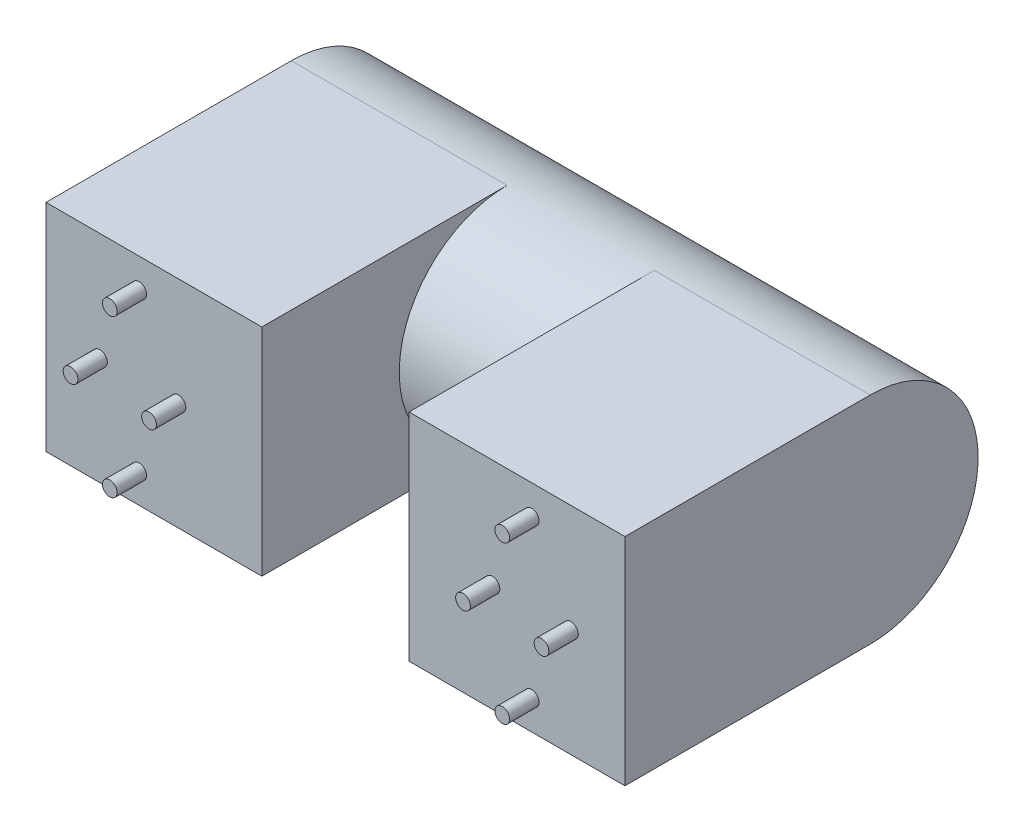
ISO-10303-21;
HEADER;
FILE_DESCRIPTION(('STEP AP214'),'2;1');
FILE_NAME('part.step','',(''),(''),'','','');
FILE_SCHEMA(('AUTOMOTIVE_DESIGN { 1 0 10303 214 1 1 1 1 }'));
ENDSEC;
DATA;
#1=APPLICATION_CONTEXT('core data for automotive mechanical design processes');
#2=APPLICATION_PROTOCOL_DEFINITION('international standard','automotive_design',2000,#1);
#3=PRODUCT_CONTEXT('',#1,'mechanical');
#4=PRODUCT('Part','Part','',(#3));
#5=PRODUCT_RELATED_PRODUCT_CATEGORY('part','',(#4));
#6=PRODUCT_DEFINITION_FORMATION('','',#4);
#7=PRODUCT_DEFINITION_CONTEXT('part definition',#1,'design');
#8=PRODUCT_DEFINITION('design','',#6,#7);
#9=PRODUCT_DEFINITION_SHAPE('','',#8);
#10=(LENGTH_UNIT() NAMED_UNIT(*) SI_UNIT(.MILLI.,.METRE.));
#11=(NAMED_UNIT(*) PLANE_ANGLE_UNIT() SI_UNIT($,.RADIAN.));
#12=(NAMED_UNIT(*) SI_UNIT($,.STERADIAN.) SOLID_ANGLE_UNIT());
#13=UNCERTAINTY_MEASURE_WITH_UNIT(LENGTH_MEASURE(1.E-05),#10,'distance_accuracy_value','');
#14=(GEOMETRIC_REPRESENTATION_CONTEXT(3) GLOBAL_UNCERTAINTY_ASSIGNED_CONTEXT((#13)) GLOBAL_UNIT_ASSIGNED_CONTEXT((#10,
#11,#12)) REPRESENTATION_CONTEXT('',''));
#15=CARTESIAN_POINT('',(0.,0.,0.));
#16=DIRECTION('',(0.,0.,1.));
#17=DIRECTION('',(1.,0.,0.));
#18=AXIS2_PLACEMENT_3D('',#15,#16,#17);
#19=CARTESIAN_POINT('',(-11.,-11.,24.25));
#20=DIRECTION('',(0.,1.,0.));
#21=DIRECTION('',(0.,0.,1.));
#22=AXIS2_PLACEMENT_3D('',#19,#20,#21);
#23=PLANE('',#22);
#24=DIRECTION('',(1.,0.,0.));
#25=VECTOR('',#24,1.);
#26=CARTESIAN_POINT('',(-11.,-11.,-0.750000000000001));
#27=LINE('',#26,#25);
#28=CARTESIAN_POINT('',(-11.,-11.,-0.750000000000001));
#29=VERTEX_POINT('',#28);
#30=CARTESIAN_POINT('',(11.,-11.,-0.750000000000001));
#31=VERTEX_POINT('',#30);
#32=EDGE_CURVE('E57',#29,#31,#27,.T.);
#33=ORIENTED_EDGE('',*,*,#32,.T.);
#34=DIRECTION('',(0.,0.,-1.));
#35=VECTOR('',#34,1.);
#36=CARTESIAN_POINT('',(11.,-11.,24.25));
#37=LINE('',#36,#35);
#38=CARTESIAN_POINT('',(11.,-11.,24.25));
#39=VERTEX_POINT('',#38);
#40=EDGE_CURVE('E123',#39,#31,#37,.T.);
#41=ORIENTED_EDGE('',*,*,#40,.F.);
#42=DIRECTION('',(1.,0.,0.));
#43=VECTOR('',#42,1.);
#44=CARTESIAN_POINT('',(-11.,-11.,24.25));
#45=LINE('',#44,#43);
#46=CARTESIAN_POINT('',(-11.,-11.,24.25));
#47=VERTEX_POINT('',#46);
#48=EDGE_CURVE('E114',#47,#39,#45,.T.);
#49=ORIENTED_EDGE('',*,*,#48,.F.);
#50=DIRECTION('',(0.,0.,-1.));
#51=VECTOR('',#50,1.);
#52=CARTESIAN_POINT('',(-11.,-11.,24.25));
#53=LINE('',#52,#51);
#54=EDGE_CURVE('E120',#47,#29,#53,.T.);
#55=ORIENTED_EDGE('',*,*,#54,.T.);
#56=EDGE_LOOP('',(#33,#41,#49,#55));
#57=FACE_BOUND('',#56,.T.);
#58=ADVANCED_FACE('F39',(#57),#23,.F.);
#59=CARTESIAN_POINT('',(48.,-11.,24.25));
#60=DIRECTION('',(0.,1.,0.));
#61=DIRECTION('',(-1.,0.,0.));
#62=AXIS2_PLACEMENT_3D('',#59,#60,#61);
#63=PLANE('',#62);
#64=CARTESIAN_POINT('',(26.,-11.,-0.750000000000001));
#65=VERTEX_POINT('',#64);
#66=CARTESIAN_POINT('',(48.,-11.,-0.749999999999999));
#67=VERTEX_POINT('',#66);
#68=EDGE_CURVE('E144',#65,#67,#27,.T.);
#69=ORIENTED_EDGE('',*,*,#68,.T.);
#70=DIRECTION('',(0.,0.,-1.));
#71=VECTOR('',#70,1.);
#72=CARTESIAN_POINT('',(48.,-11.,24.25));
#73=LINE('',#72,#71);
#74=CARTESIAN_POINT('',(48.,-11.,24.25));
#75=VERTEX_POINT('',#74);
#76=EDGE_CURVE('E149',#75,#67,#73,.T.);
#77=ORIENTED_EDGE('',*,*,#76,.F.);
#78=DIRECTION('',(1.,0.,0.));
#79=VECTOR('',#78,1.);
#80=CARTESIAN_POINT('',(48.,-11.,24.25));
#81=LINE('',#80,#79);
#82=CARTESIAN_POINT('',(26.,-11.,24.25));
#83=VERTEX_POINT('',#82);
#84=EDGE_CURVE('E162',#83,#75,#81,.T.);
#85=ORIENTED_EDGE('',*,*,#84,.F.);
#86=DIRECTION('',(0.,0.,-1.));
#87=VECTOR('',#86,1.);
#88=CARTESIAN_POINT('',(26.,-11.,24.25));
#89=LINE('',#88,#87);
#90=EDGE_CURVE('E137',#83,#65,#89,.T.);
#91=ORIENTED_EDGE('',*,*,#90,.T.);
#92=EDGE_LOOP('',(#69,#77,#85,#91));
#93=FACE_BOUND('',#92,.T.);
#94=ADVANCED_FACE('F191',(#93),#63,.F.);
#95=CARTESIAN_POINT('',(11.,11.,24.25));
#96=DIRECTION('',(-1.,0.,0.));
#97=DIRECTION('',(0.,-1.,0.));
#98=AXIS2_PLACEMENT_3D('',#95,#96,#97);
#99=PLANE('',#98);
#100=CARTESIAN_POINT('',(11.,0.,-0.750000000000001));
#101=DIRECTION('',(1.,0.,0.));
#102=DIRECTION('',(0.,1.,0.));
#103=AXIS2_PLACEMENT_3D('',#100,#101,#102);
#104=CIRCLE('',#103,11.);
#105=CARTESIAN_POINT('',(11.,11.,-0.750000000000001));
#106=VERTEX_POINT('',#105);
#107=EDGE_CURVE('E167',#106,#31,#104,.T.);
#108=ORIENTED_EDGE('',*,*,#107,.F.);
#109=DIRECTION('',(0.,0.,-1.));
#110=VECTOR('',#109,1.);
#111=CARTESIAN_POINT('',(11.,11.,24.25));
#112=LINE('',#111,#110);
#113=CARTESIAN_POINT('',(11.,11.,24.25));
#114=VERTEX_POINT('',#113);
#115=EDGE_CURVE('E11',#114,#106,#112,.T.);
#116=ORIENTED_EDGE('',*,*,#115,.F.);
#117=DIRECTION('',(0.,1.,0.));
#118=VECTOR('',#117,1.);
#119=CARTESIAN_POINT('',(11.,11.,24.25));
#120=LINE('',#119,#118);
#121=EDGE_CURVE('E172',#39,#114,#120,.T.);
#122=ORIENTED_EDGE('',*,*,#121,.F.);
#123=ORIENTED_EDGE('',*,*,#40,.T.);
#124=EDGE_LOOP('',(#108,#116,#122,#123));
#125=FACE_BOUND('',#124,.T.);
#126=ADVANCED_FACE('F41',(#125),#99,.F.);
#127=CARTESIAN_POINT('',(-11.,11.,24.25));
#128=DIRECTION('',(0.,-1.,0.));
#129=DIRECTION('',(0.,0.,-1.));
#130=AXIS2_PLACEMENT_3D('',#127,#128,#129);
#131=PLANE('',#130);
#132=ORIENTED_EDGE('',*,*,#115,.T.);
#133=DIRECTION('',(1.,0.,0.));
#134=VECTOR('',#133,1.);
#135=CARTESIAN_POINT('',(-11.,11.,-0.750000000000001));
#136=LINE('',#135,#134);
#137=CARTESIAN_POINT('',(-11.,11.,-0.750000000000001));
#138=VERTEX_POINT('',#137);
#139=EDGE_CURVE('E133',#138,#106,#136,.T.);
#140=ORIENTED_EDGE('',*,*,#139,.F.);
#141=DIRECTION('',(0.,0.,-1.));
#142=VECTOR('',#141,1.);
#143=CARTESIAN_POINT('',(-11.,11.,24.25));
#144=LINE('',#143,#142);
#145=CARTESIAN_POINT('',(-11.,11.,24.25));
#146=VERTEX_POINT('',#145);
#147=EDGE_CURVE('E49',#146,#138,#144,.T.);
#148=ORIENTED_EDGE('',*,*,#147,.F.);
#149=DIRECTION('',(-1.,0.,0.));
#150=VECTOR('',#149,1.);
#151=CARTESIAN_POINT('',(-11.,11.,24.25));
#152=LINE('',#151,#150);
#153=EDGE_CURVE('E115',#114,#146,#152,.T.);
#154=ORIENTED_EDGE('',*,*,#153,.F.);
#155=EDGE_LOOP('',(#132,#140,#148,#154));
#156=FACE_BOUND('',#155,.T.);
#157=ADVANCED_FACE('F132',(#156),#131,.F.);
#158=CARTESIAN_POINT('',(-11.,11.,24.25));
#159=DIRECTION('',(1.,0.,0.));
#160=DIRECTION('',(0.,1.,0.));
#161=AXIS2_PLACEMENT_3D('',#158,#159,#160);
#162=PLANE('',#161);
#163=ORIENTED_EDGE('',*,*,#147,.T.);
#164=CARTESIAN_POINT('',(-11.,0.,-0.750000000000001));
#165=DIRECTION('',(-1.,0.,0.));
#166=DIRECTION('',(0.,1.,0.));
#167=AXIS2_PLACEMENT_3D('',#164,#165,#166);
#168=CIRCLE('',#167,11.);
#169=EDGE_CURVE('E122',#138,#29,#168,.T.);
#170=ORIENTED_EDGE('',*,*,#169,.T.);
#171=ORIENTED_EDGE('',*,*,#54,.F.);
#172=DIRECTION('',(0.,-1.,0.));
#173=VECTOR('',#172,1.);
#174=CARTESIAN_POINT('',(-11.,11.,24.25));
#175=LINE('',#174,#173);
#176=EDGE_CURVE('E109',#146,#47,#175,.T.);
#177=ORIENTED_EDGE('',*,*,#176,.F.);
#178=EDGE_LOOP('',(#163,#170,#171,#177));
#179=FACE_BOUND('',#178,.T.);
#180=ADVANCED_FACE('F121',(#179),#162,.F.);
#181=CARTESIAN_POINT('',(0.,0.,24.25));
#182=DIRECTION('',(0.,0.,1.));
#183=DIRECTION('',(1.,0.,0.));
#184=AXIS2_PLACEMENT_3D('',#181,#182,#183);
#185=PLANE('',#184);
#186=CARTESIAN_POINT('',(-1.5,-8.,24.25));
#187=DIRECTION('',(0.,0.,1.));
#188=DIRECTION('',(1.,0.,0.));
#189=AXIS2_PLACEMENT_3D('',#186,#187,#188);
#190=CIRCLE('',#189,0.749999999999996);
#191=CARTESIAN_POINT('',(-0.750000000000007,-8.,24.25));
#192=VERTEX_POINT('',#191);
#193=EDGE_CURVE('E502',#192,#192,#190,.T.);
#194=ORIENTED_EDGE('',*,*,#193,.F.);
#195=EDGE_LOOP('',(#194));
#196=FACE_BOUND('',#195,.T.);
#197=CARTESIAN_POINT('',(-1.5,8.,24.25));
#198=DIRECTION('',(0.,0.,1.));
#199=DIRECTION('',(1.,0.,0.));
#200=AXIS2_PLACEMENT_3D('',#197,#198,#199);
#201=CIRCLE('',#200,0.75);
#202=CARTESIAN_POINT('',(-0.750000000000003,8.,24.25));
#203=VERTEX_POINT('',#202);
#204=EDGE_CURVE('E506',#203,#203,#201,.T.);
#205=ORIENTED_EDGE('',*,*,#204,.F.);
#206=EDGE_LOOP('',(#205));
#207=FACE_BOUND('',#206,.T.);
#208=CARTESIAN_POINT('',(2.5,0.,24.25));
#209=DIRECTION('',(0.,0.,1.));
#210=DIRECTION('',(1.,0.,0.));
#211=AXIS2_PLACEMENT_3D('',#208,#209,#210);
#212=CIRCLE('',#211,0.749999999999998);
#213=CARTESIAN_POINT('',(3.25,0.,24.25));
#214=VERTEX_POINT('',#213);
#215=EDGE_CURVE('E510',#214,#214,#212,.T.);
#216=ORIENTED_EDGE('',*,*,#215,.F.);
#217=EDGE_LOOP('',(#216));
#218=FACE_BOUND('',#217,.T.);
#219=CARTESIAN_POINT('',(-5.5,0.,24.25));
#220=DIRECTION('',(0.,0.,1.));
#221=DIRECTION('',(1.,0.,0.));
#222=AXIS2_PLACEMENT_3D('',#219,#220,#221);
#223=CIRCLE('',#222,0.749999999999998);
#224=CARTESIAN_POINT('',(-4.75000000000001,0.,24.25));
#225=VERTEX_POINT('',#224);
#226=EDGE_CURVE('E513',#225,#225,#223,.T.);
#227=ORIENTED_EDGE('',*,*,#226,.F.);
#228=EDGE_LOOP('',(#227));
#229=FACE_BOUND('',#228,.T.);
#230=ORIENTED_EDGE('',*,*,#121,.T.);
#231=ORIENTED_EDGE('',*,*,#153,.T.);
#232=ORIENTED_EDGE('',*,*,#176,.T.);
#233=ORIENTED_EDGE('',*,*,#48,.T.);
#234=EDGE_LOOP('',(#230,#231,#232,#233));
#235=FACE_BOUND('',#234,.T.);
#236=ADVANCED_FACE('F112',(#196,#207,#218,#229,#235),#185,.T.);
#237=CARTESIAN_POINT('',(57.1126983722081,0.,-0.750000000000001));
#238=DIRECTION('',(-1.,0.,0.));
#239=DIRECTION('',(0.,-1.,0.));
#240=AXIS2_PLACEMENT_3D('',#237,#238,#239);
#241=CYLINDRICAL_SURFACE('',#240,11.);
#242=ORIENTED_EDGE('',*,*,#107,.T.);
#243=ORIENTED_EDGE('',*,*,#32,.F.);
#244=ORIENTED_EDGE('',*,*,#169,.F.);
#245=ORIENTED_EDGE('',*,*,#139,.T.);
#246=EDGE_LOOP('',(#242,#243,#244,#245));
#247=FACE_BOUND('',#246,.T.);
#248=CARTESIAN_POINT('',(26.,0.,-0.750000000000001));
#249=DIRECTION('',(1.,0.,0.));
#250=DIRECTION('',(0.,0.,-1.));
#251=AXIS2_PLACEMENT_3D('',#248,#249,#250);
#252=CIRCLE('',#251,11.);
#253=CARTESIAN_POINT('',(26.,11.,-0.749999999999987));
#254=VERTEX_POINT('',#253);
#255=EDGE_CURVE('E169',#254,#65,#252,.T.);
#256=ORIENTED_EDGE('',*,*,#255,.F.);
#257=CARTESIAN_POINT('',(48.,11.,-0.749999999999999));
#258=VERTEX_POINT('',#257);
#259=EDGE_CURVE('E69',#254,#258,#136,.T.);
#260=ORIENTED_EDGE('',*,*,#259,.T.);
#261=CARTESIAN_POINT('',(48.,0.,-0.750000000000001));
#262=DIRECTION('',(1.,0.,0.));
#263=DIRECTION('',(0.,1.,0.));
#264=AXIS2_PLACEMENT_3D('',#261,#262,#263);
#265=CIRCLE('',#264,11.);
#266=EDGE_CURVE('E43',#258,#67,#265,.F.);
#267=ORIENTED_EDGE('',*,*,#266,.T.);
#268=ORIENTED_EDGE('',*,*,#68,.F.);
#269=EDGE_LOOP('',(#256,#260,#267,#268));
#270=FACE_BOUND('',#269,.T.);
#271=ADVANCED_FACE('F174',(#247,#270),#241,.T.);
#272=CARTESIAN_POINT('',(26.,-11.,24.25));
#273=DIRECTION('',(1.,0.,0.));
#274=DIRECTION('',(0.,0.,-1.));
#275=AXIS2_PLACEMENT_3D('',#272,#273,#274);
#276=PLANE('',#275);
#277=DIRECTION('',(0.,0.,-1.));
#278=VECTOR('',#277,1.);
#279=CARTESIAN_POINT('',(26.,11.,24.25));
#280=LINE('',#279,#278);
#281=CARTESIAN_POINT('',(26.,11.,24.25));
#282=VERTEX_POINT('',#281);
#283=EDGE_CURVE('E155',#282,#254,#280,.T.);
#284=ORIENTED_EDGE('',*,*,#283,.T.);
#285=ORIENTED_EDGE('',*,*,#255,.T.);
#286=ORIENTED_EDGE('',*,*,#90,.F.);
#287=DIRECTION('',(0.,-1.,0.));
#288=VECTOR('',#287,1.);
#289=CARTESIAN_POINT('',(26.,-11.,24.25));
#290=LINE('',#289,#288);
#291=EDGE_CURVE('E164',#282,#83,#290,.T.);
#292=ORIENTED_EDGE('',*,*,#291,.F.);
#293=EDGE_LOOP('',(#284,#285,#286,#292));
#294=FACE_BOUND('',#293,.T.);
#295=ADVANCED_FACE('F176',(#294),#276,.F.);
#296=CARTESIAN_POINT('',(48.,-11.,24.25));
#297=DIRECTION('',(-1.,0.,0.));
#298=DIRECTION('',(0.,-1.,0.));
#299=AXIS2_PLACEMENT_3D('',#296,#297,#298);
#300=PLANE('',#299);
#301=ORIENTED_EDGE('',*,*,#76,.T.);
#302=ORIENTED_EDGE('',*,*,#266,.F.);
#303=DIRECTION('',(0.,0.,-1.));
#304=VECTOR('',#303,1.);
#305=CARTESIAN_POINT('',(48.,11.,24.25));
#306=LINE('',#305,#304);
#307=CARTESIAN_POINT('',(48.,11.,24.25));
#308=VERTEX_POINT('',#307);
#309=EDGE_CURVE('E152',#308,#258,#306,.T.);
#310=ORIENTED_EDGE('',*,*,#309,.F.);
#311=DIRECTION('',(0.,1.,0.));
#312=VECTOR('',#311,1.);
#313=CARTESIAN_POINT('',(48.,-11.,24.25));
#314=LINE('',#313,#312);
#315=EDGE_CURVE('E160',#75,#308,#314,.T.);
#316=ORIENTED_EDGE('',*,*,#315,.F.);
#317=EDGE_LOOP('',(#301,#302,#310,#316));
#318=FACE_BOUND('',#317,.T.);
#319=ADVANCED_FACE('F188',(#318),#300,.F.);
#320=CARTESIAN_POINT('',(48.,11.,24.25));
#321=DIRECTION('',(0.,-1.,0.));
#322=DIRECTION('',(1.,0.,0.));
#323=AXIS2_PLACEMENT_3D('',#320,#321,#322);
#324=PLANE('',#323);
#325=ORIENTED_EDGE('',*,*,#309,.T.);
#326=ORIENTED_EDGE('',*,*,#259,.F.);
#327=ORIENTED_EDGE('',*,*,#283,.F.);
#328=DIRECTION('',(-1.,0.,0.));
#329=VECTOR('',#328,1.);
#330=CARTESIAN_POINT('',(48.,11.,24.25));
#331=LINE('',#330,#329);
#332=EDGE_CURVE('E158',#308,#282,#331,.T.);
#333=ORIENTED_EDGE('',*,*,#332,.F.);
#334=EDGE_LOOP('',(#325,#326,#327,#333));
#335=FACE_BOUND('',#334,.T.);
#336=ADVANCED_FACE('F184',(#335),#324,.F.);
#337=CARTESIAN_POINT('',(0.,0.,24.25));
#338=DIRECTION('',(0.,0.,1.));
#339=DIRECTION('',(1.,0.,0.));
#340=AXIS2_PLACEMENT_3D('',#337,#338,#339);
#341=PLANE('',#340);
#342=CARTESIAN_POINT('',(38.5,8.,24.25));
#343=DIRECTION('',(0.,0.,1.));
#344=DIRECTION('',(1.,0.,0.));
#345=AXIS2_PLACEMENT_3D('',#342,#343,#344);
#346=CIRCLE('',#345,0.749999999999999);
#347=CARTESIAN_POINT('',(39.25,8.,24.25));
#348=VERTEX_POINT('',#347);
#349=EDGE_CURVE('E547',#348,#348,#346,.T.);
#350=ORIENTED_EDGE('',*,*,#349,.F.);
#351=EDGE_LOOP('',(#350));
#352=FACE_BOUND('',#351,.T.);
#353=CARTESIAN_POINT('',(38.5,-8.,24.25));
#354=DIRECTION('',(0.,0.,1.));
#355=DIRECTION('',(1.,0.,0.));
#356=AXIS2_PLACEMENT_3D('',#353,#354,#355);
#357=CIRCLE('',#356,0.749999999999999);
#358=CARTESIAN_POINT('',(39.25,-8.,24.25));
#359=VERTEX_POINT('',#358);
#360=EDGE_CURVE('E541',#359,#359,#357,.T.);
#361=ORIENTED_EDGE('',*,*,#360,.F.);
#362=EDGE_LOOP('',(#361));
#363=FACE_BOUND('',#362,.T.);
#364=CARTESIAN_POINT('',(42.5,0.,24.25));
#365=DIRECTION('',(0.,0.,1.));
#366=DIRECTION('',(1.,0.,0.));
#367=AXIS2_PLACEMENT_3D('',#364,#365,#366);
#368=CIRCLE('',#367,0.749999999999999);
#369=CARTESIAN_POINT('',(43.25,0.,24.25));
#370=VERTEX_POINT('',#369);
#371=EDGE_CURVE('E535',#370,#370,#368,.T.);
#372=ORIENTED_EDGE('',*,*,#371,.F.);
#373=EDGE_LOOP('',(#372));
#374=FACE_BOUND('',#373,.T.);
#375=CARTESIAN_POINT('',(34.5,0.,24.25));
#376=DIRECTION('',(0.,0.,1.));
#377=DIRECTION('',(1.,0.,0.));
#378=AXIS2_PLACEMENT_3D('',#375,#376,#377);
#379=CIRCLE('',#378,0.749999999999999);
#380=CARTESIAN_POINT('',(35.25,0.,24.25));
#381=VERTEX_POINT('',#380);
#382=EDGE_CURVE('E530',#381,#381,#379,.T.);
#383=ORIENTED_EDGE('',*,*,#382,.F.);
#384=EDGE_LOOP('',(#383));
#385=FACE_BOUND('',#384,.T.);
#386=ORIENTED_EDGE('',*,*,#291,.T.);
#387=ORIENTED_EDGE('',*,*,#84,.T.);
#388=ORIENTED_EDGE('',*,*,#315,.T.);
#389=ORIENTED_EDGE('',*,*,#332,.T.);
#390=EDGE_LOOP('',(#386,#387,#388,#389));
#391=FACE_BOUND('',#390,.T.);
#392=ADVANCED_FACE('F193',(#352,#363,#374,#385,#391),#341,.T.);
#393=CARTESIAN_POINT('',(-5.5,0.,27.25));
#394=DIRECTION('',(0.,0.,-1.));
#395=DIRECTION('',(-1.,0.,0.));
#396=AXIS2_PLACEMENT_3D('',#393,#394,#395);
#397=CYLINDRICAL_SURFACE('',#396,0.749999999999998);
#398=CARTESIAN_POINT('',(-5.5,0.,27.25));
#399=DIRECTION('',(0.,0.,1.));
#400=DIRECTION('',(1.,0.,0.));
#401=AXIS2_PLACEMENT_3D('',#398,#399,#400);
#402=CIRCLE('',#401,0.749999999999998);
#403=CARTESIAN_POINT('',(-4.75000000000001,0.,27.25));
#404=VERTEX_POINT('',#403);
#405=EDGE_CURVE('E515',#404,#404,#402,.T.);
#406=ORIENTED_EDGE('',*,*,#405,.F.);
#407=EDGE_LOOP('',(#406));
#408=FACE_BOUND('',#407,.T.);
#409=ORIENTED_EDGE('',*,*,#226,.T.);
#410=EDGE_LOOP('',(#409));
#411=FACE_BOUND('',#410,.T.);
#412=ADVANCED_FACE('F195',(#408,#411),#397,.T.);
#413=CARTESIAN_POINT('',(0.,0.,27.25));
#414=DIRECTION('',(0.,0.,1.));
#415=DIRECTION('',(1.,0.,0.));
#416=AXIS2_PLACEMENT_3D('',#413,#414,#415);
#417=PLANE('',#416);
#418=ORIENTED_EDGE('',*,*,#405,.T.);
#419=EDGE_LOOP('',(#418));
#420=FACE_BOUND('',#419,.T.);
#421=ADVANCED_FACE('F203',(#420),#417,.T.);
#422=CARTESIAN_POINT('',(2.5,0.,27.25));
#423=DIRECTION('',(0.,0.,-1.));
#424=DIRECTION('',(-1.,0.,0.));
#425=AXIS2_PLACEMENT_3D('',#422,#423,#424);
#426=CYLINDRICAL_SURFACE('',#425,0.749999999999998);
#427=CARTESIAN_POINT('',(2.5,0.,27.25));
#428=DIRECTION('',(0.,0.,1.));
#429=DIRECTION('',(1.,0.,0.));
#430=AXIS2_PLACEMENT_3D('',#427,#428,#429);
#431=CIRCLE('',#430,0.749999999999998);
#432=CARTESIAN_POINT('',(3.25,0.,27.25));
#433=VERTEX_POINT('',#432);
#434=EDGE_CURVE('E518',#433,#433,#431,.T.);
#435=ORIENTED_EDGE('',*,*,#434,.F.);
#436=EDGE_LOOP('',(#435));
#437=FACE_BOUND('',#436,.T.);
#438=ORIENTED_EDGE('',*,*,#215,.T.);
#439=EDGE_LOOP('',(#438));
#440=FACE_BOUND('',#439,.T.);
#441=ADVANCED_FACE('F254',(#437,#440),#426,.T.);
#442=CARTESIAN_POINT('',(2.5,0.,27.25));
#443=DIRECTION('',(0.,0.,1.));
#444=DIRECTION('',(1.,0.,0.));
#445=AXIS2_PLACEMENT_3D('',#442,#443,#444);
#446=PLANE('',#445);
#447=ORIENTED_EDGE('',*,*,#434,.T.);
#448=EDGE_LOOP('',(#447));
#449=FACE_BOUND('',#448,.T.);
#450=ADVANCED_FACE('F264',(#449),#446,.T.);
#451=CARTESIAN_POINT('',(-1.5,8.,27.25));
#452=DIRECTION('',(0.,0.,-1.));
#453=DIRECTION('',(-1.,0.,0.));
#454=AXIS2_PLACEMENT_3D('',#451,#452,#453);
#455=CYLINDRICAL_SURFACE('',#454,0.75);
#456=CARTESIAN_POINT('',(-1.5,8.,27.25));
#457=DIRECTION('',(0.,0.,1.));
#458=DIRECTION('',(1.,0.,0.));
#459=AXIS2_PLACEMENT_3D('',#456,#457,#458);
#460=CIRCLE('',#459,0.75);
#461=CARTESIAN_POINT('',(-0.750000000000003,8.,27.25));
#462=VERTEX_POINT('',#461);
#463=EDGE_CURVE('E523',#462,#462,#460,.T.);
#464=ORIENTED_EDGE('',*,*,#463,.F.);
#465=EDGE_LOOP('',(#464));
#466=FACE_BOUND('',#465,.T.);
#467=ORIENTED_EDGE('',*,*,#204,.T.);
#468=EDGE_LOOP('',(#467));
#469=FACE_BOUND('',#468,.T.);
#470=ADVANCED_FACE('F274',(#466,#469),#455,.T.);
#471=CARTESIAN_POINT('',(-1.5,8.,27.25));
#472=DIRECTION('',(0.,0.,1.));
#473=DIRECTION('',(1.,0.,0.));
#474=AXIS2_PLACEMENT_3D('',#471,#472,#473);
#475=PLANE('',#474);
#476=ORIENTED_EDGE('',*,*,#463,.T.);
#477=EDGE_LOOP('',(#476));
#478=FACE_BOUND('',#477,.T.);
#479=ADVANCED_FACE('F284',(#478),#475,.T.);
#480=CARTESIAN_POINT('',(-1.5,-8.,27.25));
#481=DIRECTION('',(0.,0.,-1.));
#482=DIRECTION('',(-1.,0.,0.));
#483=AXIS2_PLACEMENT_3D('',#480,#481,#482);
#484=CYLINDRICAL_SURFACE('',#483,0.749999999999996);
#485=CARTESIAN_POINT('',(-1.5,-8.,27.25));
#486=DIRECTION('',(0.,0.,1.));
#487=DIRECTION('',(1.,0.,0.));
#488=AXIS2_PLACEMENT_3D('',#485,#486,#487);
#489=CIRCLE('',#488,0.749999999999996);
#490=CARTESIAN_POINT('',(-0.750000000000007,-8.,27.25));
#491=VERTEX_POINT('',#490);
#492=EDGE_CURVE('E527',#491,#491,#489,.T.);
#493=ORIENTED_EDGE('',*,*,#492,.F.);
#494=EDGE_LOOP('',(#493));
#495=FACE_BOUND('',#494,.T.);
#496=ORIENTED_EDGE('',*,*,#193,.T.);
#497=EDGE_LOOP('',(#496));
#498=FACE_BOUND('',#497,.T.);
#499=ADVANCED_FACE('F294',(#495,#498),#484,.T.);
#500=CARTESIAN_POINT('',(-1.5,-8.,27.25));
#501=DIRECTION('',(0.,0.,1.));
#502=DIRECTION('',(1.,0.,0.));
#503=AXIS2_PLACEMENT_3D('',#500,#501,#502);
#504=PLANE('',#503);
#505=ORIENTED_EDGE('',*,*,#492,.T.);
#506=EDGE_LOOP('',(#505));
#507=FACE_BOUND('',#506,.T.);
#508=ADVANCED_FACE('F304',(#507),#504,.T.);
#509=CARTESIAN_POINT('',(34.5,0.,27.25));
#510=DIRECTION('',(0.,0.,-1.));
#511=DIRECTION('',(-1.,0.,0.));
#512=AXIS2_PLACEMENT_3D('',#509,#510,#511);
#513=CYLINDRICAL_SURFACE('',#512,0.749999999999999);
#514=CARTESIAN_POINT('',(34.5,0.,27.25));
#515=DIRECTION('',(0.,0.,1.));
#516=DIRECTION('',(1.,0.,0.));
#517=AXIS2_PLACEMENT_3D('',#514,#515,#516);
#518=CIRCLE('',#517,0.749999999999999);
#519=CARTESIAN_POINT('',(35.25,0.,27.25));
#520=VERTEX_POINT('',#519);
#521=EDGE_CURVE('E532',#520,#520,#518,.T.);
#522=ORIENTED_EDGE('',*,*,#521,.F.);
#523=EDGE_LOOP('',(#522));
#524=FACE_BOUND('',#523,.T.);
#525=ORIENTED_EDGE('',*,*,#382,.T.);
#526=EDGE_LOOP('',(#525));
#527=FACE_BOUND('',#526,.T.);
#528=ADVANCED_FACE('F314',(#524,#527),#513,.T.);
#529=CARTESIAN_POINT('',(34.5,0.,27.25));
#530=DIRECTION('',(0.,0.,1.));
#531=DIRECTION('',(1.,0.,0.));
#532=AXIS2_PLACEMENT_3D('',#529,#530,#531);
#533=PLANE('',#532);
#534=ORIENTED_EDGE('',*,*,#521,.T.);
#535=EDGE_LOOP('',(#534));
#536=FACE_BOUND('',#535,.T.);
#537=ADVANCED_FACE('F324',(#536),#533,.T.);
#538=CARTESIAN_POINT('',(42.5,0.,27.25));
#539=DIRECTION('',(0.,0.,-1.));
#540=DIRECTION('',(-1.,0.,0.));
#541=AXIS2_PLACEMENT_3D('',#538,#539,#540);
#542=CYLINDRICAL_SURFACE('',#541,0.749999999999999);
#543=CARTESIAN_POINT('',(42.5,0.,27.25));
#544=DIRECTION('',(0.,0.,1.));
#545=DIRECTION('',(1.,0.,0.));
#546=AXIS2_PLACEMENT_3D('',#543,#544,#545);
#547=CIRCLE('',#546,0.749999999999999);
#548=CARTESIAN_POINT('',(43.25,0.,27.25));
#549=VERTEX_POINT('',#548);
#550=EDGE_CURVE('E538',#549,#549,#547,.T.);
#551=ORIENTED_EDGE('',*,*,#550,.F.);
#552=EDGE_LOOP('',(#551));
#553=FACE_BOUND('',#552,.T.);
#554=ORIENTED_EDGE('',*,*,#371,.T.);
#555=EDGE_LOOP('',(#554));
#556=FACE_BOUND('',#555,.T.);
#557=ADVANCED_FACE('F334',(#553,#556),#542,.T.);
#558=CARTESIAN_POINT('',(42.5,0.,27.25));
#559=DIRECTION('',(0.,0.,1.));
#560=DIRECTION('',(1.,0.,0.));
#561=AXIS2_PLACEMENT_3D('',#558,#559,#560);
#562=PLANE('',#561);
#563=ORIENTED_EDGE('',*,*,#550,.T.);
#564=EDGE_LOOP('',(#563));
#565=FACE_BOUND('',#564,.T.);
#566=ADVANCED_FACE('F344',(#565),#562,.T.);
#567=CARTESIAN_POINT('',(38.5,-8.,27.25));
#568=DIRECTION('',(0.,0.,-1.));
#569=DIRECTION('',(-1.,0.,0.));
#570=AXIS2_PLACEMENT_3D('',#567,#568,#569);
#571=CYLINDRICAL_SURFACE('',#570,0.749999999999999);
#572=CARTESIAN_POINT('',(38.5,-8.,27.25));
#573=DIRECTION('',(0.,0.,1.));
#574=DIRECTION('',(1.,0.,0.));
#575=AXIS2_PLACEMENT_3D('',#572,#573,#574);
#576=CIRCLE('',#575,0.749999999999999);
#577=CARTESIAN_POINT('',(39.25,-8.,27.25));
#578=VERTEX_POINT('',#577);
#579=EDGE_CURVE('E544',#578,#578,#576,.T.);
#580=ORIENTED_EDGE('',*,*,#579,.F.);
#581=EDGE_LOOP('',(#580));
#582=FACE_BOUND('',#581,.T.);
#583=ORIENTED_EDGE('',*,*,#360,.T.);
#584=EDGE_LOOP('',(#583));
#585=FACE_BOUND('',#584,.T.);
#586=ADVANCED_FACE('F354',(#582,#585),#571,.T.);
#587=CARTESIAN_POINT('',(38.5,-8.,27.25));
#588=DIRECTION('',(0.,0.,1.));
#589=DIRECTION('',(1.,0.,0.));
#590=AXIS2_PLACEMENT_3D('',#587,#588,#589);
#591=PLANE('',#590);
#592=ORIENTED_EDGE('',*,*,#579,.T.);
#593=EDGE_LOOP('',(#592));
#594=FACE_BOUND('',#593,.T.);
#595=ADVANCED_FACE('F364',(#594),#591,.T.);
#596=CARTESIAN_POINT('',(38.5,8.,27.25));
#597=DIRECTION('',(0.,0.,-1.));
#598=DIRECTION('',(-1.,0.,0.));
#599=AXIS2_PLACEMENT_3D('',#596,#597,#598);
#600=CYLINDRICAL_SURFACE('',#599,0.749999999999999);
#601=CARTESIAN_POINT('',(38.5,8.,27.25));
#602=DIRECTION('',(0.,0.,1.));
#603=DIRECTION('',(1.,0.,0.));
#604=AXIS2_PLACEMENT_3D('',#601,#602,#603);
#605=CIRCLE('',#604,0.749999999999999);
#606=CARTESIAN_POINT('',(39.25,8.,27.25));
#607=VERTEX_POINT('',#606);
#608=EDGE_CURVE('E550',#607,#607,#605,.T.);
#609=ORIENTED_EDGE('',*,*,#608,.F.);
#610=EDGE_LOOP('',(#609));
#611=FACE_BOUND('',#610,.T.);
#612=ORIENTED_EDGE('',*,*,#349,.T.);
#613=EDGE_LOOP('',(#612));
#614=FACE_BOUND('',#613,.T.);
#615=ADVANCED_FACE('F374',(#611,#614),#600,.T.);
#616=CARTESIAN_POINT('',(38.5,8.,27.25));
#617=DIRECTION('',(0.,0.,1.));
#618=DIRECTION('',(1.,0.,0.));
#619=AXIS2_PLACEMENT_3D('',#616,#617,#618);
#620=PLANE('',#619);
#621=ORIENTED_EDGE('',*,*,#608,.T.);
#622=EDGE_LOOP('',(#621));
#623=FACE_BOUND('',#622,.T.);
#624=ADVANCED_FACE('F384',(#623),#620,.T.);
#625=CLOSED_SHELL('',(#58,#94,#126,#157,#180,#236,#271,#295,#319,#336,#392,#412,#421,#441,#450,
#470,#479,#499,#508,#528,#537,#557,#566,#586,#595,#615,#624));
#626=MANIFOLD_SOLID_BREP('B2',#625);
#627=ADVANCED_BREP_SHAPE_REPRESENTATION('',(#18,#626),#14);
#628=SHAPE_DEFINITION_REPRESENTATION(#9,#627);
ENDSEC;
END-ISO-10303-21;
